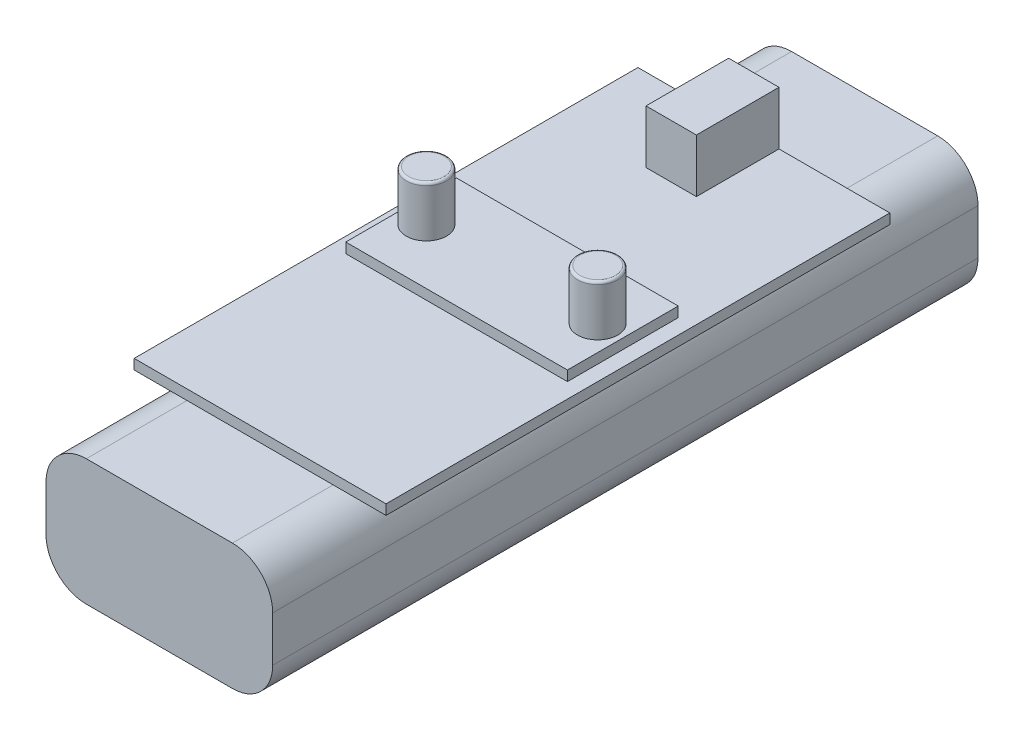
ISO-10303-21;
HEADER;
FILE_DESCRIPTION(('STEP AP214'),'2;1');
FILE_NAME('part.step','',(''),(''),'','','');
FILE_SCHEMA(('AUTOMOTIVE_DESIGN { 1 0 10303 214 1 1 1 1 }'));
ENDSEC;
DATA;
#1=APPLICATION_CONTEXT('core data for automotive mechanical design processes');
#2=APPLICATION_PROTOCOL_DEFINITION('international standard','automotive_design',2000,#1);
#3=PRODUCT_CONTEXT('',#1,'mechanical');
#4=PRODUCT('Part','Part','',(#3));
#5=PRODUCT_RELATED_PRODUCT_CATEGORY('part','',(#4));
#6=PRODUCT_DEFINITION_FORMATION('','',#4);
#7=PRODUCT_DEFINITION_CONTEXT('part definition',#1,'design');
#8=PRODUCT_DEFINITION('design','',#6,#7);
#9=PRODUCT_DEFINITION_SHAPE('','',#8);
#10=(LENGTH_UNIT() NAMED_UNIT(*) SI_UNIT(.MILLI.,.METRE.));
#11=(NAMED_UNIT(*) PLANE_ANGLE_UNIT() SI_UNIT($,.RADIAN.));
#12=(NAMED_UNIT(*) SI_UNIT($,.STERADIAN.) SOLID_ANGLE_UNIT());
#13=UNCERTAINTY_MEASURE_WITH_UNIT(LENGTH_MEASURE(1.E-05),#10,'distance_accuracy_value','');
#14=(GEOMETRIC_REPRESENTATION_CONTEXT(3) GLOBAL_UNCERTAINTY_ASSIGNED_CONTEXT((#13)) GLOBAL_UNIT_ASSIGNED_CONTEXT((#10,
#11,#12)) REPRESENTATION_CONTEXT('',''));
#15=CARTESIAN_POINT('',(0.,0.,0.));
#16=DIRECTION('',(0.,0.,1.));
#17=DIRECTION('',(1.,0.,0.));
#18=AXIS2_PLACEMENT_3D('',#15,#16,#17);
#19=CARTESIAN_POINT('',(0.,27.,0.));
#20=DIRECTION('',(0.,1.,0.));
#21=DIRECTION('',(0.,0.,1.));
#22=AXIS2_PLACEMENT_3D('',#19,#20,#21);
#23=PLANE('',#22);
#24=DIRECTION('',(0.,0.,1.));
#25=VECTOR('',#24,1.);
#26=CARTESIAN_POINT('',(-7.,27.,-50.));
#27=LINE('',#26,#25);
#28=CARTESIAN_POINT('',(-7.,27.,-50.));
#29=VERTEX_POINT('',#28);
#30=CARTESIAN_POINT('',(-7.,27.,-33.6));
#31=VERTEX_POINT('',#30);
#32=EDGE_CURVE('E216',#29,#31,#27,.T.);
#33=ORIENTED_EDGE('',*,*,#32,.F.);
#34=DIRECTION('',(-1.,0.,0.));
#35=VECTOR('',#34,1.);
#36=CARTESIAN_POINT('',(25.,27.,-50.));
#37=LINE('',#36,#35);
#38=CARTESIAN_POINT('',(-25.,27.,-50.));
#39=VERTEX_POINT('',#38);
#40=EDGE_CURVE('E257',#29,#39,#37,.T.);
#41=ORIENTED_EDGE('',*,*,#40,.T.);
#42=DIRECTION('',(0.,0.,1.));
#43=VECTOR('',#42,1.);
#44=CARTESIAN_POINT('',(-25.,27.,50.));
#45=LINE('',#44,#43);
#46=CARTESIAN_POINT('',(-25.,27.,50.));
#47=VERTEX_POINT('',#46);
#48=EDGE_CURVE('E248',#39,#47,#45,.T.);
#49=ORIENTED_EDGE('',*,*,#48,.T.);
#50=DIRECTION('',(1.,0.,0.));
#51=VECTOR('',#50,1.);
#52=CARTESIAN_POINT('',(25.,27.,50.));
#53=LINE('',#52,#51);
#54=CARTESIAN_POINT('',(25.,27.,50.));
#55=VERTEX_POINT('',#54);
#56=EDGE_CURVE('E252',#47,#55,#53,.T.);
#57=ORIENTED_EDGE('',*,*,#56,.T.);
#58=DIRECTION('',(0.,0.,-1.));
#59=VECTOR('',#58,1.);
#60=CARTESIAN_POINT('',(25.,27.,50.));
#61=LINE('',#60,#59);
#62=CARTESIAN_POINT('',(25.,27.,-50.));
#63=VERTEX_POINT('',#62);
#64=EDGE_CURVE('E255',#55,#63,#61,.T.);
#65=ORIENTED_EDGE('',*,*,#64,.T.);
#66=CARTESIAN_POINT('',(3.,27.,-50.));
#67=VERTEX_POINT('',#66);
#68=EDGE_CURVE('E258',#63,#67,#37,.T.);
#69=ORIENTED_EDGE('',*,*,#68,.T.);
#70=DIRECTION('',(0.,0.,-1.));
#71=VECTOR('',#70,1.);
#72=CARTESIAN_POINT('',(3.,27.,-50.));
#73=LINE('',#72,#71);
#74=CARTESIAN_POINT('',(3.,27.,-33.6));
#75=VERTEX_POINT('',#74);
#76=EDGE_CURVE('E227',#75,#67,#73,.T.);
#77=ORIENTED_EDGE('',*,*,#76,.F.);
#78=DIRECTION('',(1.,0.,0.));
#79=VECTOR('',#78,1.);
#80=CARTESIAN_POINT('',(-7.,27.,-33.6));
#81=LINE('',#80,#79);
#82=EDGE_CURVE('E63',#31,#75,#81,.T.);
#83=ORIENTED_EDGE('',*,*,#82,.F.);
#84=EDGE_LOOP('',(#33,#41,#49,#57,#65,#69,#77,#83));
#85=FACE_BOUND('',#84,.T.);
#86=DIRECTION('',(-1.,0.,0.));
#87=VECTOR('',#86,1.);
#88=CARTESIAN_POINT('',(-22.,27.,-11.));
#89=LINE('',#88,#87);
#90=CARTESIAN_POINT('',(22.,27.,-11.));
#91=VERTEX_POINT('',#90);
#92=CARTESIAN_POINT('',(-22.,27.,-11.));
#93=VERTEX_POINT('',#92);
#94=EDGE_CURVE('E789',#91,#93,#89,.T.);
#95=ORIENTED_EDGE('',*,*,#94,.F.);
#96=DIRECTION('',(0.,0.,-1.));
#97=VECTOR('',#96,1.);
#98=CARTESIAN_POINT('',(22.,27.,11.));
#99=LINE('',#98,#97);
#100=CARTESIAN_POINT('',(22.,27.,11.));
#101=VERTEX_POINT('',#100);
#102=EDGE_CURVE('E214',#101,#91,#99,.T.);
#103=ORIENTED_EDGE('',*,*,#102,.F.);
#104=DIRECTION('',(1.,0.,0.));
#105=VECTOR('',#104,1.);
#106=CARTESIAN_POINT('',(-22.,27.,11.));
#107=LINE('',#106,#105);
#108=CARTESIAN_POINT('',(-22.,27.,11.));
#109=VERTEX_POINT('',#108);
#110=EDGE_CURVE('E210',#109,#101,#107,.T.);
#111=ORIENTED_EDGE('',*,*,#110,.F.);
#112=DIRECTION('',(0.,0.,1.));
#113=VECTOR('',#112,1.);
#114=CARTESIAN_POINT('',(-22.,27.,11.));
#115=LINE('',#114,#113);
#116=EDGE_CURVE('E786',#93,#109,#115,.T.);
#117=ORIENTED_EDGE('',*,*,#116,.F.);
#118=EDGE_LOOP('',(#95,#103,#111,#117));
#119=FACE_BOUND('',#118,.T.);
#120=ADVANCED_FACE('F40',(#85,#119),#23,.T.);
#121=CARTESIAN_POINT('',(0.,25.,0.));
#122=DIRECTION('',(0.,-1.,0.));
#123=DIRECTION('',(0.,0.,-1.));
#124=AXIS2_PLACEMENT_3D('',#121,#122,#123);
#125=PLANE('',#124);
#126=DIRECTION('',(1.,0.,0.));
#127=VECTOR('',#126,1.);
#128=CARTESIAN_POINT('',(25.,25.,50.));
#129=LINE('',#128,#127);
#130=CARTESIAN_POINT('',(-14.5,25.,50.));
#131=VERTEX_POINT('',#130);
#132=CARTESIAN_POINT('',(14.5,25.,50.));
#133=VERTEX_POINT('',#132);
#134=EDGE_CURVE('E269',#131,#133,#129,.T.);
#135=ORIENTED_EDGE('',*,*,#134,.F.);
#136=DIRECTION('',(0.,0.,1.));
#137=VECTOR('',#136,1.);
#138=CARTESIAN_POINT('',(-14.5,25.,0.));
#139=LINE('',#138,#137);
#140=CARTESIAN_POINT('',(-14.5,25.,70.));
#141=VERTEX_POINT('',#140);
#142=EDGE_CURVE('E319',#131,#141,#139,.T.);
#143=ORIENTED_EDGE('',*,*,#142,.T.);
#144=DIRECTION('',(1.,0.,0.));
#145=VECTOR('',#144,1.);
#146=CARTESIAN_POINT('',(-22.5,25.,70.));
#147=LINE('',#146,#145);
#148=CARTESIAN_POINT('',(14.5,25.,70.));
#149=VERTEX_POINT('',#148);
#150=EDGE_CURVE('E293',#141,#149,#147,.T.);
#151=ORIENTED_EDGE('',*,*,#150,.T.);
#152=DIRECTION('',(0.,0.,-1.));
#153=VECTOR('',#152,1.);
#154=CARTESIAN_POINT('',(14.5,25.,0.));
#155=LINE('',#154,#153);
#156=EDGE_CURVE('E316',#149,#133,#155,.T.);
#157=ORIENTED_EDGE('',*,*,#156,.T.);
#158=EDGE_LOOP('',(#135,#143,#151,#157));
#159=FACE_BOUND('',#158,.T.);
#160=ADVANCED_FACE('F387',(#159),#125,.F.);
#161=DIRECTION('',(-1.,0.,0.));
#162=VECTOR('',#161,1.);
#163=CARTESIAN_POINT('',(25.,25.,-50.));
#164=LINE('',#163,#162);
#165=CARTESIAN_POINT('',(14.5,25.,-50.));
#166=VERTEX_POINT('',#165);
#167=CARTESIAN_POINT('',(-14.5,25.,-50.));
#168=VERTEX_POINT('',#167);
#169=EDGE_CURVE('E274',#166,#168,#164,.T.);
#170=ORIENTED_EDGE('',*,*,#169,.F.);
#171=CARTESIAN_POINT('',(14.5,25.,-70.));
#172=VERTEX_POINT('',#171);
#173=EDGE_CURVE('E315',#166,#172,#155,.T.);
#174=ORIENTED_EDGE('',*,*,#173,.T.);
#175=DIRECTION('',(-1.,0.,0.));
#176=VECTOR('',#175,1.);
#177=CARTESIAN_POINT('',(-22.5,25.,-70.));
#178=LINE('',#177,#176);
#179=CARTESIAN_POINT('',(-14.5,25.,-70.));
#180=VERTEX_POINT('',#179);
#181=EDGE_CURVE('E290',#172,#180,#178,.T.);
#182=ORIENTED_EDGE('',*,*,#181,.T.);
#183=EDGE_CURVE('E321',#180,#168,#139,.T.);
#184=ORIENTED_EDGE('',*,*,#183,.T.);
#185=EDGE_LOOP('',(#170,#174,#182,#184));
#186=FACE_BOUND('',#185,.T.);
#187=ADVANCED_FACE('F392',(#186),#125,.F.);
#188=CARTESIAN_POINT('',(22.5,25.,70.));
#189=DIRECTION('',(-1.,0.,0.));
#190=DIRECTION('',(0.,0.,1.));
#191=AXIS2_PLACEMENT_3D('',#188,#189,#190);
#192=PLANE('',#191);
#193=DIRECTION('',(0.,-1.,0.));
#194=VECTOR('',#193,1.);
#195=CARTESIAN_POINT('',(22.5,25.,-70.));
#196=LINE('',#195,#194);
#197=CARTESIAN_POINT('',(22.5,17.,-70.));
#198=VERTEX_POINT('',#197);
#199=CARTESIAN_POINT('',(22.5,8.,-70.));
#200=VERTEX_POINT('',#199);
#201=EDGE_CURVE('E312',#198,#200,#196,.T.);
#202=ORIENTED_EDGE('',*,*,#201,.F.);
#203=DIRECTION('',(0.,0.,-1.));
#204=VECTOR('',#203,1.);
#205=CARTESIAN_POINT('',(22.5,17.,70.));
#206=LINE('',#205,#204);
#207=CARTESIAN_POINT('',(22.5,17.,70.));
#208=VERTEX_POINT('',#207);
#209=EDGE_CURVE('E359',#198,#208,#206,.F.);
#210=ORIENTED_EDGE('',*,*,#209,.T.);
#211=DIRECTION('',(0.,-1.,0.));
#212=VECTOR('',#211,1.);
#213=CARTESIAN_POINT('',(22.5,25.,70.));
#214=LINE('',#213,#212);
#215=CARTESIAN_POINT('',(22.5,8.,70.));
#216=VERTEX_POINT('',#215);
#217=EDGE_CURVE('E298',#208,#216,#214,.T.);
#218=ORIENTED_EDGE('',*,*,#217,.T.);
#219=DIRECTION('',(0.,0.,-1.));
#220=VECTOR('',#219,1.);
#221=CARTESIAN_POINT('',(22.5,8.,-70.));
#222=LINE('',#221,#220);
#223=EDGE_CURVE('E355',#216,#200,#222,.T.);
#224=ORIENTED_EDGE('',*,*,#223,.T.);
#225=EDGE_LOOP('',(#202,#210,#218,#224));
#226=FACE_BOUND('',#225,.T.);
#227=ADVANCED_FACE('F437',(#226),#192,.F.);
#228=CARTESIAN_POINT('',(-22.5,25.,-70.));
#229=DIRECTION('',(0.,0.,1.));
#230=DIRECTION('',(1.,0.,0.));
#231=AXIS2_PLACEMENT_3D('',#228,#229,#230);
#232=PLANE('',#231);
#233=DIRECTION('',(0.,-1.,0.));
#234=VECTOR('',#233,1.);
#235=CARTESIAN_POINT('',(-22.5,25.,-70.));
#236=LINE('',#235,#234);
#237=CARTESIAN_POINT('',(-22.5,17.,-70.));
#238=VERTEX_POINT('',#237);
#239=CARTESIAN_POINT('',(-22.5,8.,-70.));
#240=VERTEX_POINT('',#239);
#241=EDGE_CURVE('E309',#238,#240,#236,.T.);
#242=ORIENTED_EDGE('',*,*,#241,.F.);
#243=CARTESIAN_POINT('',(-14.5,17.,-70.));
#244=DIRECTION('',(0.,0.,1.));
#245=DIRECTION('',(1.,0.,0.));
#246=AXIS2_PLACEMENT_3D('',#243,#244,#245);
#247=CIRCLE('',#246,8.);
#248=EDGE_CURVE('E347',#238,#180,#247,.F.);
#249=ORIENTED_EDGE('',*,*,#248,.T.);
#250=ORIENTED_EDGE('',*,*,#181,.F.);
#251=CARTESIAN_POINT('',(14.5,17.,-70.));
#252=DIRECTION('',(0.,0.,1.));
#253=DIRECTION('',(1.,0.,0.));
#254=AXIS2_PLACEMENT_3D('',#251,#252,#253);
#255=CIRCLE('',#254,8.);
#256=EDGE_CURVE('E343',#172,#198,#255,.F.);
#257=ORIENTED_EDGE('',*,*,#256,.T.);
#258=ORIENTED_EDGE('',*,*,#201,.T.);
#259=CARTESIAN_POINT('',(14.5,8.,-70.));
#260=DIRECTION('',(0.,0.,1.));
#261=DIRECTION('',(1.,0.,0.));
#262=AXIS2_PLACEMENT_3D('',#259,#260,#261);
#263=CIRCLE('',#262,8.);
#264=CARTESIAN_POINT('',(14.5,0.,-70.));
#265=VERTEX_POINT('',#264);
#266=EDGE_CURVE('E341',#200,#265,#263,.F.);
#267=ORIENTED_EDGE('',*,*,#266,.T.);
#268=DIRECTION('',(-1.,0.,0.));
#269=VECTOR('',#268,1.);
#270=CARTESIAN_POINT('',(-22.5,0.,-70.));
#271=LINE('',#270,#269);
#272=CARTESIAN_POINT('',(-14.5,0.,-70.));
#273=VERTEX_POINT('',#272);
#274=EDGE_CURVE('E289',#265,#273,#271,.T.);
#275=ORIENTED_EDGE('',*,*,#274,.T.);
#276=CARTESIAN_POINT('',(-14.5,8.,-70.));
#277=DIRECTION('',(0.,0.,1.));
#278=DIRECTION('',(1.,0.,0.));
#279=AXIS2_PLACEMENT_3D('',#276,#277,#278);
#280=CIRCLE('',#279,8.);
#281=EDGE_CURVE('E345',#273,#240,#280,.F.);
#282=ORIENTED_EDGE('',*,*,#281,.T.);
#283=EDGE_LOOP('',(#242,#249,#250,#257,#258,#267,#275,#282));
#284=FACE_BOUND('',#283,.T.);
#285=ADVANCED_FACE('F433',(#284),#232,.F.);
#286=CARTESIAN_POINT('',(-22.5,25.,70.));
#287=DIRECTION('',(1.,0.,0.));
#288=DIRECTION('',(0.,0.,-1.));
#289=AXIS2_PLACEMENT_3D('',#286,#287,#288);
#290=PLANE('',#289);
#291=DIRECTION('',(0.,-1.,0.));
#292=VECTOR('',#291,1.);
#293=CARTESIAN_POINT('',(-22.5,25.,70.));
#294=LINE('',#293,#292);
#295=CARTESIAN_POINT('',(-22.5,17.,70.));
#296=VERTEX_POINT('',#295);
#297=CARTESIAN_POINT('',(-22.5,8.,70.));
#298=VERTEX_POINT('',#297);
#299=EDGE_CURVE('E306',#296,#298,#294,.T.);
#300=ORIENTED_EDGE('',*,*,#299,.F.);
#301=DIRECTION('',(0.,0.,1.));
#302=VECTOR('',#301,1.);
#303=CARTESIAN_POINT('',(-22.5,17.,70.));
#304=LINE('',#303,#302);
#305=EDGE_CURVE('E338',#296,#238,#304,.F.);
#306=ORIENTED_EDGE('',*,*,#305,.T.);
#307=ORIENTED_EDGE('',*,*,#241,.T.);
#308=DIRECTION('',(0.,0.,1.));
#309=VECTOR('',#308,1.);
#310=CARTESIAN_POINT('',(-22.5,8.,70.));
#311=LINE('',#310,#309);
#312=EDGE_CURVE('E334',#240,#298,#311,.T.);
#313=ORIENTED_EDGE('',*,*,#312,.T.);
#314=EDGE_LOOP('',(#300,#306,#307,#313));
#315=FACE_BOUND('',#314,.T.);
#316=ADVANCED_FACE('F429',(#315),#290,.F.);
#317=CARTESIAN_POINT('',(-22.5,25.,70.));
#318=DIRECTION('',(0.,0.,-1.));
#319=DIRECTION('',(-1.,0.,0.));
#320=AXIS2_PLACEMENT_3D('',#317,#318,#319);
#321=PLANE('',#320);
#322=ORIENTED_EDGE('',*,*,#150,.F.);
#323=CARTESIAN_POINT('',(-14.5,17.,70.));
#324=DIRECTION('',(0.,0.,-1.));
#325=DIRECTION('',(-1.,0.,0.));
#326=AXIS2_PLACEMENT_3D('',#323,#324,#325);
#327=CIRCLE('',#326,8.);
#328=EDGE_CURVE('E332',#141,#296,#327,.F.);
#329=ORIENTED_EDGE('',*,*,#328,.T.);
#330=ORIENTED_EDGE('',*,*,#299,.T.);
#331=CARTESIAN_POINT('',(-14.5,8.,70.));
#332=DIRECTION('',(0.,0.,-1.));
#333=DIRECTION('',(-1.,0.,0.));
#334=AXIS2_PLACEMENT_3D('',#331,#332,#333);
#335=CIRCLE('',#334,8.);
#336=CARTESIAN_POINT('',(-14.5,0.,70.));
#337=VERTEX_POINT('',#336);
#338=EDGE_CURVE('E330',#298,#337,#335,.F.);
#339=ORIENTED_EDGE('',*,*,#338,.T.);
#340=DIRECTION('',(1.,0.,0.));
#341=VECTOR('',#340,1.);
#342=CARTESIAN_POINT('',(-22.5,0.,70.));
#343=LINE('',#342,#341);
#344=CARTESIAN_POINT('',(14.5,0.,70.));
#345=VERTEX_POINT('',#344);
#346=EDGE_CURVE('E294',#337,#345,#343,.T.);
#347=ORIENTED_EDGE('',*,*,#346,.T.);
#348=CARTESIAN_POINT('',(14.5,8.,70.));
#349=DIRECTION('',(0.,0.,-1.));
#350=DIRECTION('',(-1.,0.,0.));
#351=AXIS2_PLACEMENT_3D('',#348,#349,#350);
#352=CIRCLE('',#351,8.);
#353=EDGE_CURVE('E324',#345,#216,#352,.F.);
#354=ORIENTED_EDGE('',*,*,#353,.T.);
#355=ORIENTED_EDGE('',*,*,#217,.F.);
#356=CARTESIAN_POINT('',(14.5,17.,70.));
#357=DIRECTION('',(0.,0.,-1.));
#358=DIRECTION('',(-1.,0.,0.));
#359=AXIS2_PLACEMENT_3D('',#356,#357,#358);
#360=CIRCLE('',#359,8.);
#361=EDGE_CURVE('E327',#208,#149,#360,.F.);
#362=ORIENTED_EDGE('',*,*,#361,.T.);
#363=EDGE_LOOP('',(#322,#329,#330,#339,#347,#354,#355,#362));
#364=FACE_BOUND('',#363,.T.);
#365=ADVANCED_FACE('F425',(#364),#321,.F.);
#366=CARTESIAN_POINT('',(0.,0.,0.));
#367=DIRECTION('',(0.,-1.,0.));
#368=DIRECTION('',(0.,0.,-1.));
#369=AXIS2_PLACEMENT_3D('',#366,#367,#368);
#370=PLANE('',#369);
#371=ORIENTED_EDGE('',*,*,#346,.F.);
#372=DIRECTION('',(0.,0.,1.));
#373=VECTOR('',#372,1.);
#374=CARTESIAN_POINT('',(-14.5,0.,-70.));
#375=LINE('',#374,#373);
#376=EDGE_CURVE('E352',#337,#273,#375,.F.);
#377=ORIENTED_EDGE('',*,*,#376,.T.);
#378=ORIENTED_EDGE('',*,*,#274,.F.);
#379=DIRECTION('',(0.,0.,-1.));
#380=VECTOR('',#379,1.);
#381=CARTESIAN_POINT('',(14.5,0.,70.));
#382=LINE('',#381,#380);
#383=EDGE_CURVE('E349',#265,#345,#382,.F.);
#384=ORIENTED_EDGE('',*,*,#383,.T.);
#385=EDGE_LOOP('',(#371,#377,#378,#384));
#386=FACE_BOUND('',#385,.T.);
#387=ADVANCED_FACE('F421',(#386),#370,.T.);
#388=CARTESIAN_POINT('',(-14.5,17.,0.));
#389=DIRECTION('',(0.,0.,1.));
#390=DIRECTION('',(1.,0.,0.));
#391=AXIS2_PLACEMENT_3D('',#388,#389,#390);
#392=CYLINDRICAL_SURFACE('',#391,8.);
#393=ORIENTED_EDGE('',*,*,#248,.F.);
#394=ORIENTED_EDGE('',*,*,#305,.F.);
#395=ORIENTED_EDGE('',*,*,#328,.F.);
#396=ORIENTED_EDGE('',*,*,#142,.F.);
#397=DIRECTION('',(0.,0.,1.));
#398=VECTOR('',#397,1.);
#399=CARTESIAN_POINT('',(-14.5,25.,0.));
#400=LINE('',#399,#398);
#401=EDGE_CURVE('E286',#131,#168,#400,.F.);
#402=ORIENTED_EDGE('',*,*,#401,.T.);
#403=ORIENTED_EDGE('',*,*,#183,.F.);
#404=EDGE_LOOP('',(#393,#394,#395,#396,#402,#403));
#405=FACE_BOUND('',#404,.T.);
#406=ADVANCED_FACE('F424',(#405),#392,.T.);
#407=CARTESIAN_POINT('',(-14.5,8.,70.));
#408=DIRECTION('',(0.,0.,-1.));
#409=DIRECTION('',(-1.,0.,0.));
#410=AXIS2_PLACEMENT_3D('',#407,#408,#409);
#411=CYLINDRICAL_SURFACE('',#410,8.);
#412=ORIENTED_EDGE('',*,*,#281,.F.);
#413=ORIENTED_EDGE('',*,*,#376,.F.);
#414=ORIENTED_EDGE('',*,*,#338,.F.);
#415=ORIENTED_EDGE('',*,*,#312,.F.);
#416=EDGE_LOOP('',(#412,#413,#414,#415));
#417=FACE_BOUND('',#416,.T.);
#418=ADVANCED_FACE('F444',(#417),#411,.T.);
#419=CARTESIAN_POINT('',(14.5,17.,0.));
#420=DIRECTION('',(0.,0.,-1.));
#421=DIRECTION('',(-1.,0.,0.));
#422=AXIS2_PLACEMENT_3D('',#419,#420,#421);
#423=CYLINDRICAL_SURFACE('',#422,8.);
#424=ORIENTED_EDGE('',*,*,#361,.F.);
#425=ORIENTED_EDGE('',*,*,#209,.F.);
#426=ORIENTED_EDGE('',*,*,#256,.F.);
#427=ORIENTED_EDGE('',*,*,#173,.F.);
#428=EDGE_CURVE('E320',#133,#166,#155,.T.);
#429=ORIENTED_EDGE('',*,*,#428,.F.);
#430=ORIENTED_EDGE('',*,*,#156,.F.);
#431=EDGE_LOOP('',(#424,#425,#426,#427,#429,#430));
#432=FACE_BOUND('',#431,.T.);
#433=ADVANCED_FACE('F448',(#432),#423,.T.);
#434=CARTESIAN_POINT('',(14.5,8.,70.));
#435=DIRECTION('',(0.,0.,1.));
#436=DIRECTION('',(1.,0.,0.));
#437=AXIS2_PLACEMENT_3D('',#434,#435,#436);
#438=CYLINDRICAL_SURFACE('',#437,8.);
#439=ORIENTED_EDGE('',*,*,#353,.F.);
#440=ORIENTED_EDGE('',*,*,#383,.F.);
#441=ORIENTED_EDGE('',*,*,#266,.F.);
#442=ORIENTED_EDGE('',*,*,#223,.F.);
#443=EDGE_LOOP('',(#439,#440,#441,#442));
#444=FACE_BOUND('',#443,.T.);
#445=ADVANCED_FACE('F452',(#444),#438,.T.);
#446=CARTESIAN_POINT('',(0.,25.,0.));
#447=DIRECTION('',(0.,1.,0.));
#448=DIRECTION('',(0.,0.,1.));
#449=AXIS2_PLACEMENT_3D('',#446,#447,#448);
#450=PLANE('',#449);
#451=ORIENTED_EDGE('',*,*,#401,.F.);
#452=CARTESIAN_POINT('',(-25.,25.,50.));
#453=VERTEX_POINT('',#452);
#454=EDGE_CURVE('E265',#453,#131,#129,.T.);
#455=ORIENTED_EDGE('',*,*,#454,.F.);
#456=DIRECTION('',(0.,0.,1.));
#457=VECTOR('',#456,1.);
#458=CARTESIAN_POINT('',(-25.,25.,50.));
#459=LINE('',#458,#457);
#460=CARTESIAN_POINT('',(-25.,25.,-50.));
#461=VERTEX_POINT('',#460);
#462=EDGE_CURVE('E247',#461,#453,#459,.T.);
#463=ORIENTED_EDGE('',*,*,#462,.F.);
#464=EDGE_CURVE('E271',#168,#461,#164,.T.);
#465=ORIENTED_EDGE('',*,*,#464,.F.);
#466=EDGE_LOOP('',(#451,#455,#463,#465));
#467=FACE_BOUND('',#466,.T.);
#468=ADVANCED_FACE('F405',(#467),#450,.F.);
#469=CARTESIAN_POINT('',(-25.,27.,50.));
#470=DIRECTION('',(1.,0.,0.));
#471=DIRECTION('',(0.,0.,-1.));
#472=AXIS2_PLACEMENT_3D('',#469,#470,#471);
#473=PLANE('',#472);
#474=ORIENTED_EDGE('',*,*,#462,.T.);
#475=DIRECTION('',(0.,-1.,0.));
#476=VECTOR('',#475,1.);
#477=CARTESIAN_POINT('',(-25.,27.,50.));
#478=LINE('',#477,#476);
#479=EDGE_CURVE('E283',#47,#453,#478,.T.);
#480=ORIENTED_EDGE('',*,*,#479,.F.);
#481=ORIENTED_EDGE('',*,*,#48,.F.);
#482=DIRECTION('',(0.,-1.,0.));
#483=VECTOR('',#482,1.);
#484=CARTESIAN_POINT('',(-25.,27.,-50.));
#485=LINE('',#484,#483);
#486=EDGE_CURVE('E260',#39,#461,#485,.T.);
#487=ORIENTED_EDGE('',*,*,#486,.T.);
#488=EDGE_LOOP('',(#474,#480,#481,#487));
#489=FACE_BOUND('',#488,.T.);
#490=ADVANCED_FACE('F416',(#489),#473,.F.);
#491=CARTESIAN_POINT('',(25.,27.,50.));
#492=DIRECTION('',(0.,0.,-1.));
#493=DIRECTION('',(-1.,0.,0.));
#494=AXIS2_PLACEMENT_3D('',#491,#492,#493);
#495=PLANE('',#494);
#496=ORIENTED_EDGE('',*,*,#454,.T.);
#497=ORIENTED_EDGE('',*,*,#134,.T.);
#498=CARTESIAN_POINT('',(25.,25.,50.));
#499=VERTEX_POINT('',#498);
#500=EDGE_CURVE('E264',#133,#499,#129,.T.);
#501=ORIENTED_EDGE('',*,*,#500,.T.);
#502=DIRECTION('',(0.,-1.,0.));
#503=VECTOR('',#502,1.);
#504=CARTESIAN_POINT('',(25.,27.,50.));
#505=LINE('',#504,#503);
#506=EDGE_CURVE('E280',#55,#499,#505,.T.);
#507=ORIENTED_EDGE('',*,*,#506,.F.);
#508=ORIENTED_EDGE('',*,*,#56,.F.);
#509=ORIENTED_EDGE('',*,*,#479,.T.);
#510=EDGE_LOOP('',(#496,#497,#501,#507,#508,#509));
#511=FACE_BOUND('',#510,.T.);
#512=ADVANCED_FACE('F412',(#511),#495,.F.);
#513=CARTESIAN_POINT('',(25.,27.,50.));
#514=DIRECTION('',(-1.,0.,0.));
#515=DIRECTION('',(0.,0.,1.));
#516=AXIS2_PLACEMENT_3D('',#513,#514,#515);
#517=PLANE('',#516);
#518=DIRECTION('',(0.,0.,-1.));
#519=VECTOR('',#518,1.);
#520=CARTESIAN_POINT('',(25.,25.,50.));
#521=LINE('',#520,#519);
#522=CARTESIAN_POINT('',(25.,25.,-50.));
#523=VERTEX_POINT('',#522);
#524=EDGE_CURVE('E268',#499,#523,#521,.T.);
#525=ORIENTED_EDGE('',*,*,#524,.T.);
#526=DIRECTION('',(0.,-1.,0.));
#527=VECTOR('',#526,1.);
#528=CARTESIAN_POINT('',(25.,27.,-50.));
#529=LINE('',#528,#527);
#530=EDGE_CURVE('E277',#63,#523,#529,.T.);
#531=ORIENTED_EDGE('',*,*,#530,.F.);
#532=ORIENTED_EDGE('',*,*,#64,.F.);
#533=ORIENTED_EDGE('',*,*,#506,.T.);
#534=EDGE_LOOP('',(#525,#531,#532,#533));
#535=FACE_BOUND('',#534,.T.);
#536=ADVANCED_FACE('F408',(#535),#517,.F.);
#537=CARTESIAN_POINT('',(25.,27.,-50.));
#538=DIRECTION('',(0.,0.,1.));
#539=DIRECTION('',(1.,0.,0.));
#540=AXIS2_PLACEMENT_3D('',#537,#538,#539);
#541=PLANE('',#540);
#542=EDGE_CURVE('E253',#523,#166,#164,.T.);
#543=ORIENTED_EDGE('',*,*,#542,.T.);
#544=ORIENTED_EDGE('',*,*,#169,.T.);
#545=ORIENTED_EDGE('',*,*,#464,.T.);
#546=ORIENTED_EDGE('',*,*,#486,.F.);
#547=ORIENTED_EDGE('',*,*,#40,.F.);
#548=DIRECTION('',(0.,-1.,0.));
#549=VECTOR('',#548,1.);
#550=CARTESIAN_POINT('',(-7.,37.6,-50.));
#551=LINE('',#550,#549);
#552=CARTESIAN_POINT('',(-7.,37.6,-50.));
#553=VERTEX_POINT('',#552);
#554=EDGE_CURVE('E232',#553,#29,#551,.T.);
#555=ORIENTED_EDGE('',*,*,#554,.F.);
#556=DIRECTION('',(-1.,0.,0.));
#557=VECTOR('',#556,1.);
#558=CARTESIAN_POINT('',(-7.,37.6,-50.));
#559=LINE('',#558,#557);
#560=CARTESIAN_POINT('',(3.,37.6,-50.));
#561=VERTEX_POINT('',#560);
#562=EDGE_CURVE('E231',#561,#553,#559,.T.);
#563=ORIENTED_EDGE('',*,*,#562,.F.);
#564=DIRECTION('',(0.,-1.,0.));
#565=VECTOR('',#564,1.);
#566=CARTESIAN_POINT('',(3.,37.6,-50.));
#567=LINE('',#566,#565);
#568=EDGE_CURVE('E239',#561,#67,#567,.T.);
#569=ORIENTED_EDGE('',*,*,#568,.T.);
#570=ORIENTED_EDGE('',*,*,#68,.F.);
#571=ORIENTED_EDGE('',*,*,#530,.T.);
#572=EDGE_LOOP('',(#543,#544,#545,#546,#547,#555,#563,#569,#570,#571));
#573=FACE_BOUND('',#572,.T.);
#574=ADVANCED_FACE('F403',(#573),#541,.F.);
#575=ORIENTED_EDGE('',*,*,#428,.T.);
#576=ORIENTED_EDGE('',*,*,#542,.F.);
#577=ORIENTED_EDGE('',*,*,#524,.F.);
#578=ORIENTED_EDGE('',*,*,#500,.F.);
#579=EDGE_LOOP('',(#575,#576,#577,#578));
#580=FACE_BOUND('',#579,.T.);
#581=ADVANCED_FACE('F400',(#580),#450,.F.);
#582=CARTESIAN_POINT('',(-7.,37.6,-50.));
#583=DIRECTION('',(1.,0.,0.));
#584=DIRECTION('',(0.,0.,-1.));
#585=AXIS2_PLACEMENT_3D('',#582,#583,#584);
#586=PLANE('',#585);
#587=ORIENTED_EDGE('',*,*,#32,.T.);
#588=DIRECTION('',(0.,-1.,0.));
#589=VECTOR('',#588,1.);
#590=CARTESIAN_POINT('',(-7.,37.6,-33.6));
#591=LINE('',#590,#589);
#592=CARTESIAN_POINT('',(-7.,37.6,-33.6));
#593=VERTEX_POINT('',#592);
#594=EDGE_CURVE('E245',#593,#31,#591,.T.);
#595=ORIENTED_EDGE('',*,*,#594,.F.);
#596=DIRECTION('',(0.,0.,1.));
#597=VECTOR('',#596,1.);
#598=CARTESIAN_POINT('',(-7.,37.6,-50.));
#599=LINE('',#598,#597);
#600=EDGE_CURVE('E223',#553,#593,#599,.T.);
#601=ORIENTED_EDGE('',*,*,#600,.F.);
#602=ORIENTED_EDGE('',*,*,#554,.T.);
#603=EDGE_LOOP('',(#587,#595,#601,#602));
#604=FACE_BOUND('',#603,.T.);
#605=ADVANCED_FACE('F398',(#604),#586,.F.);
#606=CARTESIAN_POINT('',(-7.,37.6,-33.6));
#607=DIRECTION('',(0.,0.,-1.));
#608=DIRECTION('',(-1.,0.,0.));
#609=AXIS2_PLACEMENT_3D('',#606,#607,#608);
#610=PLANE('',#609);
#611=ORIENTED_EDGE('',*,*,#82,.T.);
#612=DIRECTION('',(0.,-1.,0.));
#613=VECTOR('',#612,1.);
#614=CARTESIAN_POINT('',(3.,37.6,-33.6));
#615=LINE('',#614,#613);
#616=CARTESIAN_POINT('',(3.,37.6,-33.6));
#617=VERTEX_POINT('',#616);
#618=EDGE_CURVE('E242',#617,#75,#615,.T.);
#619=ORIENTED_EDGE('',*,*,#618,.F.);
#620=DIRECTION('',(1.,0.,0.));
#621=VECTOR('',#620,1.);
#622=CARTESIAN_POINT('',(-7.,37.6,-33.6));
#623=LINE('',#622,#621);
#624=EDGE_CURVE('E226',#593,#617,#623,.T.);
#625=ORIENTED_EDGE('',*,*,#624,.F.);
#626=ORIENTED_EDGE('',*,*,#594,.T.);
#627=EDGE_LOOP('',(#611,#619,#625,#626));
#628=FACE_BOUND('',#627,.T.);
#629=ADVANCED_FACE('F515',(#628),#610,.F.);
#630=CARTESIAN_POINT('',(3.,37.6,-50.));
#631=DIRECTION('',(-1.,0.,0.));
#632=DIRECTION('',(0.,0.,1.));
#633=AXIS2_PLACEMENT_3D('',#630,#631,#632);
#634=PLANE('',#633);
#635=ORIENTED_EDGE('',*,*,#76,.T.);
#636=ORIENTED_EDGE('',*,*,#568,.F.);
#637=DIRECTION('',(0.,0.,-1.));
#638=VECTOR('',#637,1.);
#639=CARTESIAN_POINT('',(3.,37.6,-50.));
#640=LINE('',#639,#638);
#641=EDGE_CURVE('E229',#617,#561,#640,.T.);
#642=ORIENTED_EDGE('',*,*,#641,.F.);
#643=ORIENTED_EDGE('',*,*,#618,.T.);
#644=EDGE_LOOP('',(#635,#636,#642,#643));
#645=FACE_BOUND('',#644,.T.);
#646=ADVANCED_FACE('F513',(#645),#634,.F.);
#647=CARTESIAN_POINT('',(0.,37.6,0.));
#648=DIRECTION('',(0.,1.,0.));
#649=DIRECTION('',(0.,0.,1.));
#650=AXIS2_PLACEMENT_3D('',#647,#648,#649);
#651=PLANE('',#650);
#652=ORIENTED_EDGE('',*,*,#600,.T.);
#653=ORIENTED_EDGE('',*,*,#624,.T.);
#654=ORIENTED_EDGE('',*,*,#641,.T.);
#655=ORIENTED_EDGE('',*,*,#562,.T.);
#656=EDGE_LOOP('',(#652,#653,#654,#655));
#657=FACE_BOUND('',#656,.T.);
#658=ADVANCED_FACE('F509',(#657),#651,.T.);
#659=CARTESIAN_POINT('',(22.,29.,11.));
#660=DIRECTION('',(-1.,0.,0.));
#661=DIRECTION('',(0.,0.,1.));
#662=AXIS2_PLACEMENT_3D('',#659,#660,#661);
#663=PLANE('',#662);
#664=ORIENTED_EDGE('',*,*,#102,.T.);
#665=DIRECTION('',(0.,-1.,0.));
#666=VECTOR('',#665,1.);
#667=CARTESIAN_POINT('',(22.,29.,-11.));
#668=LINE('',#667,#666);
#669=CARTESIAN_POINT('',(22.,29.,-11.));
#670=VERTEX_POINT('',#669);
#671=EDGE_CURVE('E195',#670,#91,#668,.T.);
#672=ORIENTED_EDGE('',*,*,#671,.F.);
#673=DIRECTION('',(0.,0.,-1.));
#674=VECTOR('',#673,1.);
#675=CARTESIAN_POINT('',(22.,29.,11.));
#676=LINE('',#675,#674);
#677=CARTESIAN_POINT('',(22.,29.,11.));
#678=VERTEX_POINT('',#677);
#679=EDGE_CURVE('E202',#678,#670,#676,.T.);
#680=ORIENTED_EDGE('',*,*,#679,.F.);
#681=DIRECTION('',(0.,-1.,0.));
#682=VECTOR('',#681,1.);
#683=CARTESIAN_POINT('',(22.,29.,11.));
#684=LINE('',#683,#682);
#685=EDGE_CURVE('E784',#678,#101,#684,.T.);
#686=ORIENTED_EDGE('',*,*,#685,.T.);
#687=EDGE_LOOP('',(#664,#672,#680,#686));
#688=FACE_BOUND('',#687,.T.);
#689=ADVANCED_FACE('F212',(#688),#663,.F.);
#690=CARTESIAN_POINT('',(-22.,29.,-11.));
#691=DIRECTION('',(0.,0.,1.));
#692=DIRECTION('',(1.,0.,0.));
#693=AXIS2_PLACEMENT_3D('',#690,#691,#692);
#694=PLANE('',#693);
#695=ORIENTED_EDGE('',*,*,#94,.T.);
#696=DIRECTION('',(0.,-1.,0.));
#697=VECTOR('',#696,1.);
#698=CARTESIAN_POINT('',(-22.,29.,-11.));
#699=LINE('',#698,#697);
#700=CARTESIAN_POINT('',(-22.,29.,-11.));
#701=VERTEX_POINT('',#700);
#702=EDGE_CURVE('E198',#701,#93,#699,.T.);
#703=ORIENTED_EDGE('',*,*,#702,.F.);
#704=DIRECTION('',(-1.,0.,0.));
#705=VECTOR('',#704,1.);
#706=CARTESIAN_POINT('',(-22.,29.,-11.));
#707=LINE('',#706,#705);
#708=EDGE_CURVE('E191',#670,#701,#707,.T.);
#709=ORIENTED_EDGE('',*,*,#708,.F.);
#710=ORIENTED_EDGE('',*,*,#671,.T.);
#711=EDGE_LOOP('',(#695,#703,#709,#710));
#712=FACE_BOUND('',#711,.T.);
#713=ADVANCED_FACE('F193',(#712),#694,.F.);
#714=CARTESIAN_POINT('',(-22.,29.,11.));
#715=DIRECTION('',(1.,0.,0.));
#716=DIRECTION('',(0.,0.,-1.));
#717=AXIS2_PLACEMENT_3D('',#714,#715,#716);
#718=PLANE('',#717);
#719=ORIENTED_EDGE('',*,*,#116,.T.);
#720=DIRECTION('',(0.,-1.,0.));
#721=VECTOR('',#720,1.);
#722=CARTESIAN_POINT('',(-22.,29.,11.));
#723=LINE('',#722,#721);
#724=CARTESIAN_POINT('',(-22.,29.,11.));
#725=VERTEX_POINT('',#724);
#726=EDGE_CURVE('E55',#725,#109,#723,.T.);
#727=ORIENTED_EDGE('',*,*,#726,.F.);
#728=DIRECTION('',(0.,0.,1.));
#729=VECTOR('',#728,1.);
#730=CARTESIAN_POINT('',(-22.,29.,11.));
#731=LINE('',#730,#729);
#732=EDGE_CURVE('E201',#701,#725,#731,.T.);
#733=ORIENTED_EDGE('',*,*,#732,.F.);
#734=ORIENTED_EDGE('',*,*,#702,.T.);
#735=EDGE_LOOP('',(#719,#727,#733,#734));
#736=FACE_BOUND('',#735,.T.);
#737=ADVANCED_FACE('F529',(#736),#718,.F.);
#738=CARTESIAN_POINT('',(-22.,29.,11.));
#739=DIRECTION('',(0.,0.,-1.));
#740=DIRECTION('',(-1.,0.,0.));
#741=AXIS2_PLACEMENT_3D('',#738,#739,#740);
#742=PLANE('',#741);
#743=ORIENTED_EDGE('',*,*,#110,.T.);
#744=ORIENTED_EDGE('',*,*,#685,.F.);
#745=DIRECTION('',(1.,0.,0.));
#746=VECTOR('',#745,1.);
#747=CARTESIAN_POINT('',(-22.,29.,11.));
#748=LINE('',#747,#746);
#749=EDGE_CURVE('E206',#725,#678,#748,.T.);
#750=ORIENTED_EDGE('',*,*,#749,.F.);
#751=ORIENTED_EDGE('',*,*,#726,.T.);
#752=EDGE_LOOP('',(#743,#744,#750,#751));
#753=FACE_BOUND('',#752,.T.);
#754=ADVANCED_FACE('F532',(#753),#742,.F.);
#755=CARTESIAN_POINT('',(0.,29.,0.));
#756=DIRECTION('',(0.,-1.,0.));
#757=DIRECTION('',(0.,0.,-1.));
#758=AXIS2_PLACEMENT_3D('',#755,#756,#757);
#759=PLANE('',#758);
#760=CARTESIAN_POINT('',(-17.,29.,-0.0135702265291471));
#761=DIRECTION('',(0.,-1.,0.));
#762=DIRECTION('',(0.,0.,-1.));
#763=AXIS2_PLACEMENT_3D('',#760,#761,#762);
#764=CIRCLE('',#763,4.);
#765=CARTESIAN_POINT('',(-17.,29.,-4.01357022652915));
#766=VERTEX_POINT('',#765);
#767=EDGE_CURVE('E365',#766,#766,#764,.F.);
#768=ORIENTED_EDGE('',*,*,#767,.F.);
#769=EDGE_LOOP('',(#768));
#770=FACE_BOUND('',#769,.T.);
#771=CARTESIAN_POINT('',(17.,29.,0.));
#772=DIRECTION('',(0.,-1.,0.));
#773=DIRECTION('',(0.,0.,-1.));
#774=AXIS2_PLACEMENT_3D('',#771,#772,#773);
#775=CIRCLE('',#774,4.);
#776=CARTESIAN_POINT('',(17.,29.,-4.));
#777=VERTEX_POINT('',#776);
#778=EDGE_CURVE('E362',#777,#777,#775,.F.);
#779=ORIENTED_EDGE('',*,*,#778,.F.);
#780=EDGE_LOOP('',(#779));
#781=FACE_BOUND('',#780,.T.);
#782=ORIENTED_EDGE('',*,*,#679,.T.);
#783=ORIENTED_EDGE('',*,*,#708,.T.);
#784=ORIENTED_EDGE('',*,*,#732,.T.);
#785=ORIENTED_EDGE('',*,*,#749,.T.);
#786=EDGE_LOOP('',(#782,#783,#784,#785));
#787=FACE_BOUND('',#786,.T.);
#788=ADVANCED_FACE('F205',(#770,#781,#787),#759,.F.);
#789=CARTESIAN_POINT('',(17.,39.,0.));
#790=DIRECTION('',(0.,-1.,0.));
#791=DIRECTION('',(0.,0.,-1.));
#792=AXIS2_PLACEMENT_3D('',#789,#790,#791);
#793=CYLINDRICAL_SURFACE('',#792,4.);
#794=CARTESIAN_POINT('',(17.,38.5,0.));
#795=DIRECTION('',(0.,1.,0.));
#796=DIRECTION('',(0.,0.,1.));
#797=AXIS2_PLACEMENT_3D('',#794,#795,#796);
#798=CIRCLE('',#797,4.);
#799=CARTESIAN_POINT('',(17.,38.5,4.));
#800=VERTEX_POINT('',#799);
#801=EDGE_CURVE('E371',#800,#800,#798,.F.);
#802=ORIENTED_EDGE('',*,*,#801,.T.);
#803=EDGE_LOOP('',(#802));
#804=FACE_BOUND('',#803,.T.);
#805=ORIENTED_EDGE('',*,*,#778,.T.);
#806=EDGE_LOOP('',(#805));
#807=FACE_BOUND('',#806,.T.);
#808=ADVANCED_FACE('F538',(#804,#807),#793,.T.);
#809=CARTESIAN_POINT('',(17.,39.,0.));
#810=DIRECTION('',(0.,1.,0.));
#811=DIRECTION('',(0.,0.,1.));
#812=AXIS2_PLACEMENT_3D('',#809,#810,#811);
#813=PLANE('',#812);
#814=CARTESIAN_POINT('',(17.,39.,0.));
#815=DIRECTION('',(0.,1.,0.));
#816=DIRECTION('',(0.,0.,1.));
#817=AXIS2_PLACEMENT_3D('',#814,#815,#816);
#818=CIRCLE('',#817,3.5);
#819=CARTESIAN_POINT('',(17.,39.,3.5));
#820=VERTEX_POINT('',#819);
#821=EDGE_CURVE('E368',#820,#820,#818,.T.);
#822=ORIENTED_EDGE('',*,*,#821,.T.);
#823=EDGE_LOOP('',(#822));
#824=FACE_BOUND('',#823,.T.);
#825=ADVANCED_FACE('F542',(#824),#813,.T.);
#826=CARTESIAN_POINT('',(-17.,39.,-0.0135702265291471));
#827=DIRECTION('',(0.,-1.,0.));
#828=DIRECTION('',(0.,0.,-1.));
#829=AXIS2_PLACEMENT_3D('',#826,#827,#828);
#830=CYLINDRICAL_SURFACE('',#829,4.);
#831=CARTESIAN_POINT('',(-17.,38.5,-0.0135702265291471));
#832=DIRECTION('',(0.,1.,0.));
#833=DIRECTION('',(0.,0.,1.));
#834=AXIS2_PLACEMENT_3D('',#831,#832,#833);
#835=CIRCLE('',#834,4.);
#836=CARTESIAN_POINT('',(-17.,38.5,3.98642977347085));
#837=VERTEX_POINT('',#836);
#838=EDGE_CURVE('E11',#837,#837,#835,.F.);
#839=ORIENTED_EDGE('',*,*,#838,.T.);
#840=EDGE_LOOP('',(#839));
#841=FACE_BOUND('',#840,.T.);
#842=ORIENTED_EDGE('',*,*,#767,.T.);
#843=EDGE_LOOP('',(#842));
#844=FACE_BOUND('',#843,.T.);
#845=ADVANCED_FACE('F546',(#841,#844),#830,.T.);
#846=CARTESIAN_POINT('',(-17.,39.,-0.0135702265291471));
#847=DIRECTION('',(0.,1.,0.));
#848=DIRECTION('',(0.,0.,1.));
#849=AXIS2_PLACEMENT_3D('',#846,#847,#848);
#850=PLANE('',#849);
#851=CARTESIAN_POINT('',(-17.,39.,-0.0135702265291471));
#852=DIRECTION('',(0.,1.,0.));
#853=DIRECTION('',(0.,0.,1.));
#854=AXIS2_PLACEMENT_3D('',#851,#852,#853);
#855=CIRCLE('',#854,3.5);
#856=CARTESIAN_POINT('',(-17.,39.,3.48642977347085));
#857=VERTEX_POINT('',#856);
#858=EDGE_CURVE('E48',#857,#857,#855,.T.);
#859=ORIENTED_EDGE('',*,*,#858,.T.);
#860=EDGE_LOOP('',(#859));
#861=FACE_BOUND('',#860,.T.);
#862=ADVANCED_FACE('F376',(#861),#850,.T.);
#863=CARTESIAN_POINT('',(17.,38.5,0.));
#864=DIRECTION('',(0.,1.,0.));
#865=DIRECTION('',(0.,0.,1.));
#866=AXIS2_PLACEMENT_3D('',#863,#864,#865);
#867=TOROIDAL_SURFACE('',#866,3.5,0.5);
#868=ORIENTED_EDGE('',*,*,#801,.F.);
#869=EDGE_LOOP('',(#868));
#870=FACE_BOUND('',#869,.T.);
#871=ORIENTED_EDGE('',*,*,#821,.F.);
#872=EDGE_LOOP('',(#871));
#873=FACE_BOUND('',#872,.T.);
#874=ADVANCED_FACE('F379',(#870,#873),#867,.T.);
#875=CARTESIAN_POINT('',(-17.,38.5,-0.0135702265291471));
#876=DIRECTION('',(0.,1.,0.));
#877=DIRECTION('',(0.,0.,1.));
#878=AXIS2_PLACEMENT_3D('',#875,#876,#877);
#879=TOROIDAL_SURFACE('',#878,3.5,0.5);
#880=ORIENTED_EDGE('',*,*,#838,.F.);
#881=EDGE_LOOP('',(#880));
#882=FACE_BOUND('',#881,.T.);
#883=ORIENTED_EDGE('',*,*,#858,.F.);
#884=EDGE_LOOP('',(#883));
#885=FACE_BOUND('',#884,.T.);
#886=ADVANCED_FACE('F42',(#882,#885),#879,.T.);
#887=CLOSED_SHELL('',(#120,#160,#187,#227,#285,#316,#365,#387,#406,#418,#433,#445,#468,#490,
#512,#536,#574,#581,#605,#629,#646,#658,#689,#713,#737,#754,#788,#808,#825,#845,#862,#874,#886));
#888=MANIFOLD_SOLID_BREP('B2',#887);
#889=ADVANCED_BREP_SHAPE_REPRESENTATION('',(#18,#888),#14);
#890=SHAPE_DEFINITION_REPRESENTATION(#9,#889);
ENDSEC;
END-ISO-10303-21;
